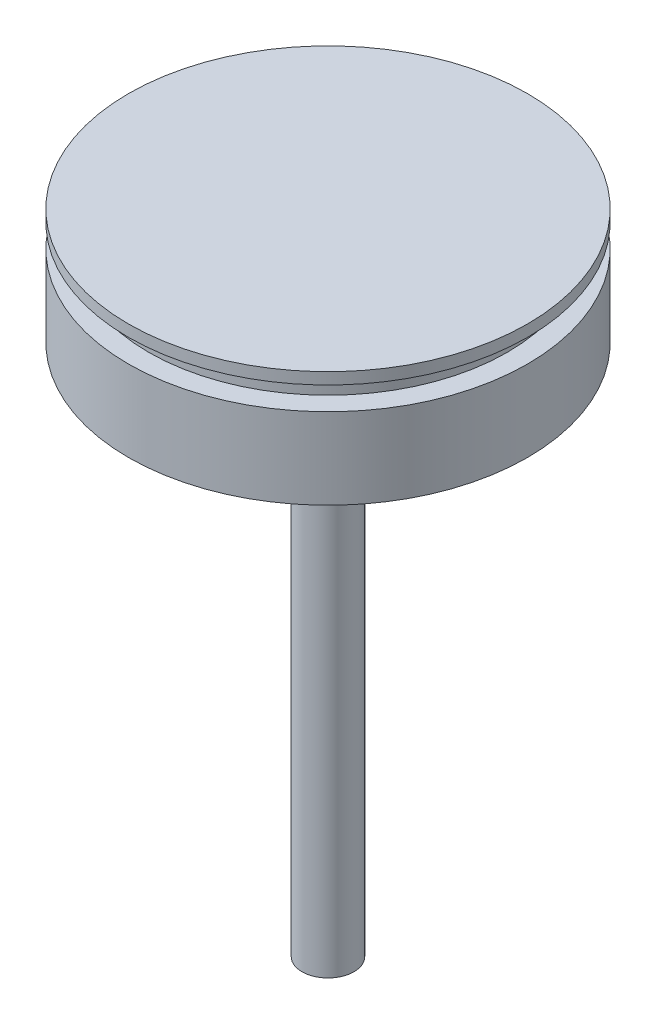
ISO-10303-21;
HEADER;
FILE_DESCRIPTION(('STEP AP214'),'2;1');
FILE_NAME('part.step','',(''),(''),'','','');
FILE_SCHEMA(('AUTOMOTIVE_DESIGN { 1 0 10303 214 1 1 1 1 }'));
ENDSEC;
DATA;
#1=APPLICATION_CONTEXT('core data for automotive mechanical design processes');
#2=APPLICATION_PROTOCOL_DEFINITION('international standard','automotive_design',2000,#1);
#3=PRODUCT_CONTEXT('',#1,'mechanical');
#4=PRODUCT('Part','Part','',(#3));
#5=PRODUCT_RELATED_PRODUCT_CATEGORY('part','',(#4));
#6=PRODUCT_DEFINITION_FORMATION('','',#4);
#7=PRODUCT_DEFINITION_CONTEXT('part definition',#1,'design');
#8=PRODUCT_DEFINITION('design','',#6,#7);
#9=PRODUCT_DEFINITION_SHAPE('','',#8);
#10=(LENGTH_UNIT() NAMED_UNIT(*) SI_UNIT(.MILLI.,.METRE.));
#11=(NAMED_UNIT(*) PLANE_ANGLE_UNIT() SI_UNIT($,.RADIAN.));
#12=(NAMED_UNIT(*) SI_UNIT($,.STERADIAN.) SOLID_ANGLE_UNIT());
#13=UNCERTAINTY_MEASURE_WITH_UNIT(LENGTH_MEASURE(1.E-05),#10,'distance_accuracy_value','');
#14=(GEOMETRIC_REPRESENTATION_CONTEXT(3) GLOBAL_UNCERTAINTY_ASSIGNED_CONTEXT((#13)) GLOBAL_UNIT_ASSIGNED_CONTEXT((#10,
#11,#12)) REPRESENTATION_CONTEXT('',''));
#15=CARTESIAN_POINT('',(0.,0.,0.));
#16=DIRECTION('',(0.,0.,1.));
#17=DIRECTION('',(1.,0.,0.));
#18=AXIS2_PLACEMENT_3D('',#15,#16,#17);
#19=CARTESIAN_POINT('',(0.,0.,0.));
#20=DIRECTION('',(0.,1.,0.));
#21=DIRECTION('',(0.,0.,1.));
#22=AXIS2_PLACEMENT_3D('',#19,#20,#21);
#23=PLANE('',#22);
#24=CARTESIAN_POINT('',(0.,0.,0.));
#25=DIRECTION('',(0.,-1.,0.));
#26=DIRECTION('',(0.,0.,-1.));
#27=AXIS2_PLACEMENT_3D('',#24,#25,#26);
#28=CIRCLE('',#27,34.5);
#29=CARTESIAN_POINT('',(0.,0.,-34.5));
#30=VERTEX_POINT('',#29);
#31=EDGE_CURVE('E10',#30,#30,#28,.T.);
#32=ORIENTED_EDGE('',*,*,#31,.F.);
#33=EDGE_LOOP('',(#32));
#34=FACE_BOUND('',#33,.T.);
#35=ADVANCED_FACE('F34',(#34),#23,.T.);
#36=CARTESIAN_POINT('',(0.,-20.,0.));
#37=DIRECTION('',(0.,-1.,0.));
#38=DIRECTION('',(0.,0.,-1.));
#39=AXIS2_PLACEMENT_3D('',#36,#37,#38);
#40=CYLINDRICAL_SURFACE('',#39,34.5);
#41=ORIENTED_EDGE('',*,*,#31,.T.);
#42=EDGE_LOOP('',(#41));
#43=FACE_BOUND('',#42,.T.);
#44=CARTESIAN_POINT('',(0.,-2.,0.));
#45=DIRECTION('',(0.,-1.,0.));
#46=DIRECTION('',(0.,0.,-1.));
#47=AXIS2_PLACEMENT_3D('',#44,#45,#46);
#48=CIRCLE('',#47,34.5);
#49=CARTESIAN_POINT('',(0.,-2.,-34.5));
#50=VERTEX_POINT('',#49);
#51=EDGE_CURVE('E40',#50,#50,#48,.T.);
#52=ORIENTED_EDGE('',*,*,#51,.F.);
#53=EDGE_LOOP('',(#52));
#54=FACE_BOUND('',#53,.T.);
#55=ADVANCED_FACE('F92',(#43,#54),#40,.T.);
#56=CARTESIAN_POINT('',(0.,-2.,-34.5));
#57=DIRECTION('',(0.,-1.,0.));
#58=DIRECTION('',(0.,0.,-1.));
#59=AXIS2_PLACEMENT_3D('',#56,#57,#58);
#60=PLANE('',#59);
#61=ORIENTED_EDGE('',*,*,#51,.T.);
#62=EDGE_LOOP('',(#61));
#63=FACE_BOUND('',#62,.T.);
#64=CARTESIAN_POINT('',(0.,-2.,0.));
#65=DIRECTION('',(0.,-1.,0.));
#66=DIRECTION('',(0.,0.,-1.));
#67=AXIS2_PLACEMENT_3D('',#64,#65,#66);
#68=CIRCLE('',#67,31.);
#69=CARTESIAN_POINT('',(0.,-2.,-31.));
#70=VERTEX_POINT('',#69);
#71=EDGE_CURVE('E44',#70,#70,#68,.T.);
#72=ORIENTED_EDGE('',*,*,#71,.F.);
#73=EDGE_LOOP('',(#72));
#74=FACE_BOUND('',#73,.T.);
#75=ADVANCED_FACE('F97',(#63,#74),#60,.T.);
#76=CARTESIAN_POINT('',(0.,-20.,0.));
#77=DIRECTION('',(0.,-1.,0.));
#78=DIRECTION('',(0.,0.,-1.));
#79=AXIS2_PLACEMENT_3D('',#76,#77,#78);
#80=CYLINDRICAL_SURFACE('',#79,31.);
#81=ORIENTED_EDGE('',*,*,#71,.T.);
#82=EDGE_LOOP('',(#81));
#83=FACE_BOUND('',#82,.T.);
#84=CARTESIAN_POINT('',(0.,-6.,0.));
#85=DIRECTION('',(0.,-1.,0.));
#86=DIRECTION('',(0.,0.,-1.));
#87=AXIS2_PLACEMENT_3D('',#84,#85,#86);
#88=CIRCLE('',#87,31.);
#89=CARTESIAN_POINT('',(0.,-6.,-31.));
#90=VERTEX_POINT('',#89);
#91=EDGE_CURVE('E48',#90,#90,#88,.T.);
#92=ORIENTED_EDGE('',*,*,#91,.F.);
#93=EDGE_LOOP('',(#92));
#94=FACE_BOUND('',#93,.T.);
#95=ADVANCED_FACE('F88',(#83,#94),#80,.T.);
#96=CARTESIAN_POINT('',(0.,-6.,-31.));
#97=DIRECTION('',(0.,1.,0.));
#98=DIRECTION('',(0.,0.,1.));
#99=AXIS2_PLACEMENT_3D('',#96,#97,#98);
#100=PLANE('',#99);
#101=ORIENTED_EDGE('',*,*,#91,.T.);
#102=EDGE_LOOP('',(#101));
#103=FACE_BOUND('',#102,.T.);
#104=CARTESIAN_POINT('',(0.,-6.,0.));
#105=DIRECTION('',(0.,-1.,0.));
#106=DIRECTION('',(0.,0.,-1.));
#107=AXIS2_PLACEMENT_3D('',#104,#105,#106);
#108=CIRCLE('',#107,34.5);
#109=CARTESIAN_POINT('',(0.,-6.,-34.5));
#110=VERTEX_POINT('',#109);
#111=EDGE_CURVE('E53',#110,#110,#108,.T.);
#112=ORIENTED_EDGE('',*,*,#111,.F.);
#113=EDGE_LOOP('',(#112));
#114=FACE_BOUND('',#113,.T.);
#115=ADVANCED_FACE('F82',(#103,#114),#100,.T.);
#116=CARTESIAN_POINT('',(0.,-20.,0.));
#117=DIRECTION('',(0.,-1.,0.));
#118=DIRECTION('',(0.,0.,-1.));
#119=AXIS2_PLACEMENT_3D('',#116,#117,#118);
#120=CYLINDRICAL_SURFACE('',#119,34.5);
#121=ORIENTED_EDGE('',*,*,#111,.T.);
#122=EDGE_LOOP('',(#121));
#123=FACE_BOUND('',#122,.T.);
#124=CARTESIAN_POINT('',(0.,-20.,0.));
#125=DIRECTION('',(0.,-1.,0.));
#126=DIRECTION('',(0.,0.,-1.));
#127=AXIS2_PLACEMENT_3D('',#124,#125,#126);
#128=CIRCLE('',#127,34.5);
#129=CARTESIAN_POINT('',(0.,-20.,-34.5));
#130=VERTEX_POINT('',#129);
#131=EDGE_CURVE('E56',#130,#130,#128,.T.);
#132=ORIENTED_EDGE('',*,*,#131,.F.);
#133=EDGE_LOOP('',(#132));
#134=FACE_BOUND('',#133,.T.);
#135=ADVANCED_FACE('F77',(#123,#134),#120,.T.);
#136=CARTESIAN_POINT('',(0.,-20.,0.));
#137=DIRECTION('',(0.,-1.,0.));
#138=DIRECTION('',(0.,0.,-1.));
#139=AXIS2_PLACEMENT_3D('',#136,#137,#138);
#140=PLANE('',#139);
#141=CARTESIAN_POINT('',(0.,-20.,0.));
#142=DIRECTION('',(0.,-1.,0.));
#143=DIRECTION('',(0.,0.,-1.));
#144=AXIS2_PLACEMENT_3D('',#141,#142,#143);
#145=CIRCLE('',#144,4.5);
#146=CARTESIAN_POINT('',(0.,-20.,-4.5));
#147=VERTEX_POINT('',#146);
#148=EDGE_CURVE('E60',#147,#147,#145,.T.);
#149=ORIENTED_EDGE('',*,*,#148,.F.);
#150=EDGE_LOOP('',(#149));
#151=FACE_BOUND('',#150,.T.);
#152=ORIENTED_EDGE('',*,*,#131,.T.);
#153=EDGE_LOOP('',(#152));
#154=FACE_BOUND('',#153,.T.);
#155=ADVANCED_FACE('F71',(#151,#154),#140,.T.);
#156=CARTESIAN_POINT('',(0.,-112.,0.));
#157=DIRECTION('',(0.,1.,0.));
#158=DIRECTION('',(0.,0.,1.));
#159=AXIS2_PLACEMENT_3D('',#156,#157,#158);
#160=CYLINDRICAL_SURFACE('',#159,4.5);
#161=CARTESIAN_POINT('',(0.,-112.,0.));
#162=DIRECTION('',(0.,-1.,0.));
#163=DIRECTION('',(0.,0.,-1.));
#164=AXIS2_PLACEMENT_3D('',#161,#162,#163);
#165=CIRCLE('',#164,4.5);
#166=CARTESIAN_POINT('',(0.,-112.,-4.5));
#167=VERTEX_POINT('',#166);
#168=EDGE_CURVE('E59',#167,#167,#165,.T.);
#169=ORIENTED_EDGE('',*,*,#168,.F.);
#170=EDGE_LOOP('',(#169));
#171=FACE_BOUND('',#170,.T.);
#172=ORIENTED_EDGE('',*,*,#148,.T.);
#173=EDGE_LOOP('',(#172));
#174=FACE_BOUND('',#173,.T.);
#175=ADVANCED_FACE('F68',(#171,#174),#160,.T.);
#176=CARTESIAN_POINT('',(0.,-112.,0.));
#177=DIRECTION('',(0.,-1.,0.));
#178=DIRECTION('',(0.,0.,-1.));
#179=AXIS2_PLACEMENT_3D('',#176,#177,#178);
#180=PLANE('',#179);
#181=ORIENTED_EDGE('',*,*,#168,.T.);
#182=EDGE_LOOP('',(#181));
#183=FACE_BOUND('',#182,.T.);
#184=ADVANCED_FACE('F66',(#183),#180,.T.);
#185=CLOSED_SHELL('',(#35,#55,#75,#95,#115,#135,#155,#175,#184));
#186=MANIFOLD_SOLID_BREP('B2',#185);
#187=ADVANCED_BREP_SHAPE_REPRESENTATION('',(#18,#186),#14);
#188=SHAPE_DEFINITION_REPRESENTATION(#9,#187);
ENDSEC;
END-ISO-10303-21;
